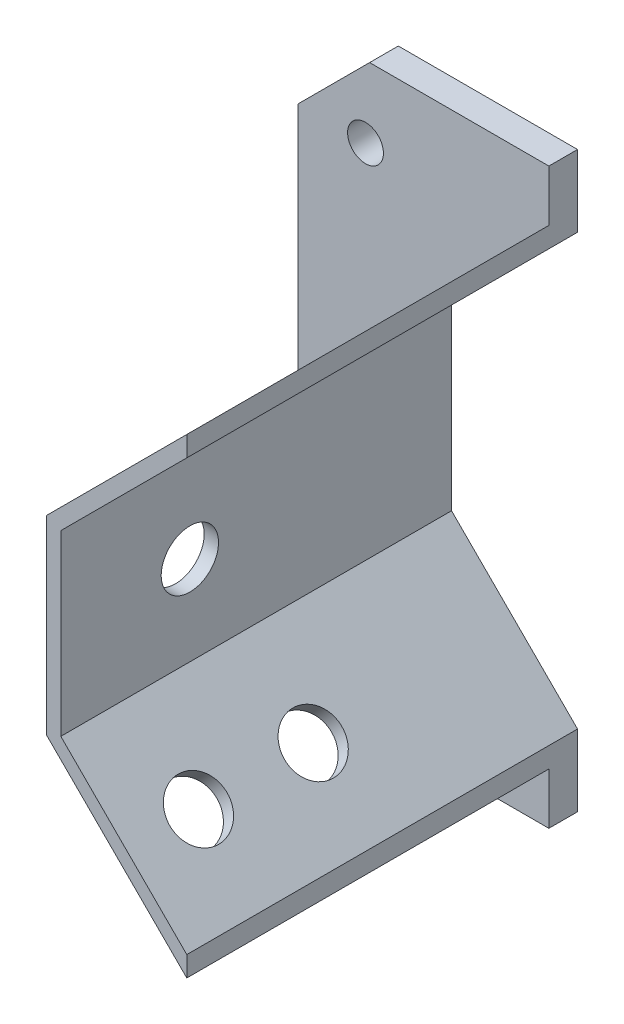
ISO-10303-21;
HEADER;
FILE_DESCRIPTION(('STEP AP214'),'2;1');
FILE_NAME('part.step','',(''),(''),'','','');
FILE_SCHEMA(('AUTOMOTIVE_DESIGN { 1 0 10303 214 1 1 1 1 }'));
ENDSEC;
DATA;
#1=APPLICATION_CONTEXT('core data for automotive mechanical design processes');
#2=APPLICATION_PROTOCOL_DEFINITION('international standard','automotive_design',2000,#1);
#3=PRODUCT_CONTEXT('',#1,'mechanical');
#4=PRODUCT('Part','Part','',(#3));
#5=PRODUCT_RELATED_PRODUCT_CATEGORY('part','',(#4));
#6=PRODUCT_DEFINITION_FORMATION('','',#4);
#7=PRODUCT_DEFINITION_CONTEXT('part definition',#1,'design');
#8=PRODUCT_DEFINITION('design','',#6,#7);
#9=PRODUCT_DEFINITION_SHAPE('','',#8);
#10=(LENGTH_UNIT() NAMED_UNIT(*) SI_UNIT(.MILLI.,.METRE.));
#11=(NAMED_UNIT(*) PLANE_ANGLE_UNIT() SI_UNIT($,.RADIAN.));
#12=(NAMED_UNIT(*) SI_UNIT($,.STERADIAN.) SOLID_ANGLE_UNIT());
#13=UNCERTAINTY_MEASURE_WITH_UNIT(LENGTH_MEASURE(1.E-05),#10,'distance_accuracy_value','');
#14=(GEOMETRIC_REPRESENTATION_CONTEXT(3) GLOBAL_UNCERTAINTY_ASSIGNED_CONTEXT((#13)) GLOBAL_UNIT_ASSIGNED_CONTEXT((#10,
#11,#12)) REPRESENTATION_CONTEXT('',''));
#15=CARTESIAN_POINT('',(0.,0.,0.));
#16=DIRECTION('',(0.,0.,1.));
#17=DIRECTION('',(1.,0.,0.));
#18=AXIS2_PLACEMENT_3D('',#15,#16,#17);
#19=CARTESIAN_POINT('',(-12.4264068711931,-32.8284271247461,50.5));
#20=DIRECTION('',(0.707106781186551,0.707106781186544,0.));
#21=DIRECTION('',(-0.707106781186544,0.707106781186551,0.));
#22=AXIS2_PLACEMENT_3D('',#19,#20,#21);
#23=PLANE('',#22);
#24=CARTESIAN_POINT('',(-22.2132034355965,-23.0416305603425,40.5));
#25=DIRECTION('',(0.707106781186551,0.707106781186544,0.));
#26=DIRECTION('',(-0.707106781186544,0.707106781186551,0.));
#27=AXIS2_PLACEMENT_3D('',#24,#25,#26);
#28=CIRCLE('',#27,4.);
#29=CARTESIAN_POINT('',(-25.0416305603427,-20.2132034355963,40.5));
#30=VERTEX_POINT('',#29);
#31=EDGE_CURVE('E244',#30,#30,#28,.T.);
#32=ORIENTED_EDGE('',*,*,#31,.T.);
#33=EDGE_LOOP('',(#32));
#34=FACE_BOUND('',#33,.T.);
#35=DIRECTION('',(0.707106781186544,-0.707106781186551,0.));
#36=VECTOR('',#35,1.);
#37=CARTESIAN_POINT('',(-12.4264068711931,-32.8284271247461,0.));
#38=LINE('',#37,#36);
#39=CARTESIAN_POINT('',(-32.,-13.2548339959389,0.));
#40=VERTEX_POINT('',#39);
#41=CARTESIAN_POINT('',(-12.4264068711931,-32.8284271247461,0.));
#42=VERTEX_POINT('',#41);
#43=EDGE_CURVE('E195',#40,#42,#38,.T.);
#44=ORIENTED_EDGE('',*,*,#43,.T.);
#45=DIRECTION('',(0.,0.,-1.));
#46=VECTOR('',#45,1.);
#47=CARTESIAN_POINT('',(-12.4264068711931,-32.8284271247461,50.5));
#48=LINE('',#47,#46);
#49=CARTESIAN_POINT('',(-12.4264068711931,-32.8284271247461,50.5));
#50=VERTEX_POINT('',#49);
#51=EDGE_CURVE('E222',#50,#42,#48,.T.);
#52=ORIENTED_EDGE('',*,*,#51,.F.);
#53=DIRECTION('',(0.707106781186544,-0.707106781186551,0.));
#54=VECTOR('',#53,1.);
#55=CARTESIAN_POINT('',(-12.4264068711931,-32.8284271247461,50.5));
#56=LINE('',#55,#54);
#57=CARTESIAN_POINT('',(-32.,-13.2548339959389,50.5));
#58=VERTEX_POINT('',#57);
#59=EDGE_CURVE('E203',#58,#50,#56,.T.);
#60=ORIENTED_EDGE('',*,*,#59,.F.);
#61=DIRECTION('',(0.,0.,-1.));
#62=VECTOR('',#61,1.);
#63=CARTESIAN_POINT('',(-32.,-13.2548339959389,50.5));
#64=LINE('',#63,#62);
#65=EDGE_CURVE('E225',#58,#40,#64,.T.);
#66=ORIENTED_EDGE('',*,*,#65,.T.);
#67=EDGE_LOOP('',(#44,#52,#60,#66));
#68=FACE_BOUND('',#67,.T.);
#69=CARTESIAN_POINT('',(-22.2132034355965,-23.0416305603425,24.5));
#70=DIRECTION('',(0.707106781186551,0.707106781186544,0.));
#71=DIRECTION('',(-0.707106781186544,0.707106781186551,0.));
#72=AXIS2_PLACEMENT_3D('',#69,#70,#71);
#73=CIRCLE('',#72,4.);
#74=CARTESIAN_POINT('',(-25.0416305603427,-20.2132034355963,24.5));
#75=VERTEX_POINT('',#74);
#76=EDGE_CURVE('E247',#75,#75,#73,.T.);
#77=ORIENTED_EDGE('',*,*,#76,.T.);
#78=EDGE_LOOP('',(#77));
#79=FACE_BOUND('',#78,.T.);
#80=ADVANCED_FACE('F32',(#34,#68,#79),#23,.F.);
#81=CARTESIAN_POINT('',(-12.4264068711931,-29.9999999999999,50.5));
#82=DIRECTION('',(-0.707106781186551,-0.707106781186544,0.));
#83=DIRECTION('',(0.707106781186544,-0.707106781186551,0.));
#84=AXIS2_PLACEMENT_3D('',#81,#82,#83);
#85=PLANE('',#84);
#86=CARTESIAN_POINT('',(-20.7989898732234,-21.6274169979694,40.5));
#87=DIRECTION('',(-0.707106781186551,-0.707106781186544,0.));
#88=DIRECTION('',(0.707106781186544,-0.707106781186551,0.));
#89=AXIS2_PLACEMENT_3D('',#86,#87,#88);
#90=CIRCLE('',#89,4.);
#91=CARTESIAN_POINT('',(-17.9705627484773,-24.4558441227156,40.5));
#92=VERTEX_POINT('',#91);
#93=EDGE_CURVE('E240',#92,#92,#90,.F.);
#94=ORIENTED_EDGE('',*,*,#93,.F.);
#95=EDGE_LOOP('',(#94));
#96=FACE_BOUND('',#95,.T.);
#97=DIRECTION('',(0.,0.,-1.));
#98=VECTOR('',#97,1.);
#99=CARTESIAN_POINT('',(-12.4264068711931,-29.9999999999999,50.5));
#100=LINE('',#99,#98);
#101=CARTESIAN_POINT('',(-12.4264068711931,-29.9999999999999,50.5));
#102=VERTEX_POINT('',#101);
#103=CARTESIAN_POINT('',(-12.4264068711931,-29.9999999999999,-4.));
#104=VERTEX_POINT('',#103);
#105=EDGE_CURVE('E226',#102,#104,#100,.T.);
#106=ORIENTED_EDGE('',*,*,#105,.T.);
#107=DIRECTION('',(0.707106781186544,-0.707106781186551,0.));
#108=VECTOR('',#107,1.);
#109=CARTESIAN_POINT('',(-12.4264068711931,-29.9999999999999,-4.));
#110=LINE('',#109,#108);
#111=CARTESIAN_POINT('',(-30.,-12.4264068711928,-4.));
#112=VERTEX_POINT('',#111);
#113=EDGE_CURVE('E158',#112,#104,#110,.T.);
#114=ORIENTED_EDGE('',*,*,#113,.F.);
#115=DIRECTION('',(0.,0.,-1.));
#116=VECTOR('',#115,1.);
#117=CARTESIAN_POINT('',(-30.,-12.4264068711928,50.5));
#118=LINE('',#117,#116);
#119=CARTESIAN_POINT('',(-30.,-12.4264068711928,50.5));
#120=VERTEX_POINT('',#119);
#121=EDGE_CURVE('E155',#120,#112,#118,.T.);
#122=ORIENTED_EDGE('',*,*,#121,.F.);
#123=DIRECTION('',(-0.707106781186544,0.707106781186551,0.));
#124=VECTOR('',#123,1.);
#125=CARTESIAN_POINT('',(-12.4264068711931,-29.9999999999999,50.5));
#126=LINE('',#125,#124);
#127=EDGE_CURVE('E207',#102,#120,#126,.T.);
#128=ORIENTED_EDGE('',*,*,#127,.F.);
#129=EDGE_LOOP('',(#106,#114,#122,#128));
#130=FACE_BOUND('',#129,.T.);
#131=CARTESIAN_POINT('',(-20.7989898732234,-21.6274169979694,24.5));
#132=DIRECTION('',(-0.707106781186551,-0.707106781186544,0.));
#133=DIRECTION('',(0.707106781186544,-0.707106781186551,0.));
#134=AXIS2_PLACEMENT_3D('',#131,#132,#133);
#135=CIRCLE('',#134,4.);
#136=CARTESIAN_POINT('',(-17.9705627484773,-24.4558441227156,24.5));
#137=VERTEX_POINT('',#136);
#138=EDGE_CURVE('E245',#137,#137,#135,.F.);
#139=ORIENTED_EDGE('',*,*,#138,.F.);
#140=EDGE_LOOP('',(#139));
#141=FACE_BOUND('',#140,.T.);
#142=ADVANCED_FACE('F298',(#96,#130,#141),#85,.F.);
#143=CARTESIAN_POINT('',(-30.,12.4264068711928,50.5));
#144=DIRECTION('',(-1.,0.,0.));
#145=DIRECTION('',(0.,0.,1.));
#146=AXIS2_PLACEMENT_3D('',#143,#144,#145);
#147=PLANE('',#146);
#148=CARTESIAN_POINT('',(-30.,0.,32.5));
#149=DIRECTION('',(-1.,0.,0.));
#150=DIRECTION('',(0.,0.,1.));
#151=AXIS2_PLACEMENT_3D('',#148,#149,#150);
#152=CIRCLE('',#151,4.);
#153=CARTESIAN_POINT('',(-30.,0.,36.5));
#154=VERTEX_POINT('',#153);
#155=EDGE_CURVE('E267',#154,#154,#152,.T.);
#156=ORIENTED_EDGE('',*,*,#155,.T.);
#157=EDGE_LOOP('',(#156));
#158=FACE_BOUND('',#157,.T.);
#159=ORIENTED_EDGE('',*,*,#121,.T.);
#160=DIRECTION('',(0.,-1.,0.));
#161=VECTOR('',#160,1.);
#162=CARTESIAN_POINT('',(-30.,-12.4264068711928,-4.));
#163=LINE('',#162,#161);
#164=CARTESIAN_POINT('',(-30.,12.4264068711928,-4.));
#165=VERTEX_POINT('',#164);
#166=EDGE_CURVE('E152',#165,#112,#163,.T.);
#167=ORIENTED_EDGE('',*,*,#166,.F.);
#168=DIRECTION('',(0.,0.,-1.));
#169=VECTOR('',#168,1.);
#170=CARTESIAN_POINT('',(-30.,12.4264068711928,50.5));
#171=LINE('',#170,#169);
#172=CARTESIAN_POINT('',(-30.,12.4264068711928,50.5));
#173=VERTEX_POINT('',#172);
#174=EDGE_CURVE('E138',#173,#165,#171,.T.);
#175=ORIENTED_EDGE('',*,*,#174,.F.);
#176=DIRECTION('',(0.,1.,0.));
#177=VECTOR('',#176,1.);
#178=CARTESIAN_POINT('',(-30.,12.4264068711928,50.5));
#179=LINE('',#178,#177);
#180=EDGE_CURVE('E193',#120,#173,#179,.T.);
#181=ORIENTED_EDGE('',*,*,#180,.F.);
#182=EDGE_LOOP('',(#159,#167,#175,#181));
#183=FACE_BOUND('',#182,.T.);
#184=ADVANCED_FACE('F153',(#158,#183),#147,.F.);
#185=CARTESIAN_POINT('',(-12.4264068711931,29.9999999999999,50.5));
#186=DIRECTION('',(-0.707106781186551,0.707106781186544,0.));
#187=DIRECTION('',(-0.707106781186544,-0.707106781186551,0.));
#188=AXIS2_PLACEMENT_3D('',#185,#186,#187);
#189=PLANE('',#188);
#190=CARTESIAN_POINT('',(-20.7989898732234,21.6274169979694,24.5));
#191=DIRECTION('',(-0.707106781186551,0.707106781186544,0.));
#192=DIRECTION('',(-0.707106781186544,-0.707106781186551,0.));
#193=AXIS2_PLACEMENT_3D('',#190,#191,#192);
#194=CIRCLE('',#193,4.);
#195=CARTESIAN_POINT('',(-23.6274169979696,18.7989898732232,24.5));
#196=VERTEX_POINT('',#195);
#197=EDGE_CURVE('E273',#196,#196,#194,.T.);
#198=ORIENTED_EDGE('',*,*,#197,.T.);
#199=EDGE_LOOP('',(#198));
#200=FACE_BOUND('',#199,.T.);
#201=CARTESIAN_POINT('',(-20.7989898732234,21.6274169979694,40.5));
#202=DIRECTION('',(-0.707106781186551,0.707106781186544,0.));
#203=DIRECTION('',(-0.707106781186544,-0.707106781186551,0.));
#204=AXIS2_PLACEMENT_3D('',#201,#202,#203);
#205=CIRCLE('',#204,4.);
#206=CARTESIAN_POINT('',(-23.6274169979696,18.7989898732232,40.5));
#207=VERTEX_POINT('',#206);
#208=EDGE_CURVE('E170',#207,#207,#205,.T.);
#209=ORIENTED_EDGE('',*,*,#208,.T.);
#210=EDGE_LOOP('',(#209));
#211=FACE_BOUND('',#210,.T.);
#212=ORIENTED_EDGE('',*,*,#174,.T.);
#213=DIRECTION('',(-0.707106781186544,-0.707106781186551,0.));
#214=VECTOR('',#213,1.);
#215=CARTESIAN_POINT('',(-30.,12.4264068711928,-4.));
#216=LINE('',#215,#214);
#217=CARTESIAN_POINT('',(-12.4264068711931,29.9999999999999,-4.));
#218=VERTEX_POINT('',#217);
#219=EDGE_CURVE('E143',#218,#165,#216,.T.);
#220=ORIENTED_EDGE('',*,*,#219,.F.);
#221=DIRECTION('',(0.,0.,-1.));
#222=VECTOR('',#221,1.);
#223=CARTESIAN_POINT('',(-12.4264068711931,29.9999999999999,50.5));
#224=LINE('',#223,#222);
#225=CARTESIAN_POINT('',(-12.4264068711931,29.9999999999999,50.5));
#226=VERTEX_POINT('',#225);
#227=EDGE_CURVE('E149',#226,#218,#224,.T.);
#228=ORIENTED_EDGE('',*,*,#227,.F.);
#229=DIRECTION('',(0.707106781186544,0.707106781186551,0.));
#230=VECTOR('',#229,1.);
#231=CARTESIAN_POINT('',(-12.4264068711931,29.9999999999999,50.5));
#232=LINE('',#231,#230);
#233=EDGE_CURVE('E144',#173,#226,#232,.T.);
#234=ORIENTED_EDGE('',*,*,#233,.F.);
#235=EDGE_LOOP('',(#212,#220,#228,#234));
#236=FACE_BOUND('',#235,.T.);
#237=ADVANCED_FACE('F140',(#200,#211,#236),#189,.F.);
#238=CARTESIAN_POINT('',(-12.4264068711931,29.9999999999999,50.5));
#239=DIRECTION('',(-1.,0.,0.));
#240=DIRECTION('',(0.,0.,1.));
#241=AXIS2_PLACEMENT_3D('',#238,#239,#240);
#242=PLANE('',#241);
#243=ORIENTED_EDGE('',*,*,#227,.T.);
#244=DIRECTION('',(0.,-1.,0.));
#245=VECTOR('',#244,1.);
#246=CARTESIAN_POINT('',(-12.4264068711931,29.9999999999999,-4.));
#247=LINE('',#246,#245);
#248=CARTESIAN_POINT('',(-12.4264068711931,39.9999999999999,-4.));
#249=VERTEX_POINT('',#248);
#250=EDGE_CURVE('E163',#249,#218,#247,.T.);
#251=ORIENTED_EDGE('',*,*,#250,.F.);
#252=DIRECTION('',(0.,0.,1.));
#253=VECTOR('',#252,1.);
#254=CARTESIAN_POINT('',(-12.4264068711931,39.9999999999999,-4.));
#255=LINE('',#254,#253);
#256=CARTESIAN_POINT('',(-12.4264068711931,39.9999999999999,0.));
#257=VERTEX_POINT('',#256);
#258=EDGE_CURVE('E183',#249,#257,#255,.T.);
#259=ORIENTED_EDGE('',*,*,#258,.T.);
#260=DIRECTION('',(0.,-1.,0.));
#261=VECTOR('',#260,1.);
#262=CARTESIAN_POINT('',(-12.4264068711931,29.9999999999999,0.));
#263=LINE('',#262,#261);
#264=CARTESIAN_POINT('',(-12.4264068711931,32.8284271247461,0.));
#265=VERTEX_POINT('',#264);
#266=EDGE_CURVE('E164',#257,#265,#263,.T.);
#267=ORIENTED_EDGE('',*,*,#266,.T.);
#268=DIRECTION('',(0.,0.,-1.));
#269=VECTOR('',#268,1.);
#270=CARTESIAN_POINT('',(-12.4264068711931,32.8284271247461,50.5));
#271=LINE('',#270,#269);
#272=CARTESIAN_POINT('',(-12.4264068711931,32.8284271247461,50.5));
#273=VERTEX_POINT('',#272);
#274=EDGE_CURVE('E367',#273,#265,#271,.T.);
#275=ORIENTED_EDGE('',*,*,#274,.F.);
#276=DIRECTION('',(0.,1.,0.));
#277=VECTOR('',#276,1.);
#278=CARTESIAN_POINT('',(-12.4264068711931,29.9999999999999,50.5));
#279=LINE('',#278,#277);
#280=EDGE_CURVE('E197',#226,#273,#279,.T.);
#281=ORIENTED_EDGE('',*,*,#280,.F.);
#282=EDGE_LOOP('',(#243,#251,#259,#267,#275,#281));
#283=FACE_BOUND('',#282,.T.);
#284=ADVANCED_FACE('F317',(#283),#242,.F.);
#285=CARTESIAN_POINT('',(-12.4264068711931,32.8284271247461,50.5));
#286=DIRECTION('',(0.707106781186551,-0.707106781186544,0.));
#287=DIRECTION('',(0.707106781186544,0.707106781186551,0.));
#288=AXIS2_PLACEMENT_3D('',#285,#286,#287);
#289=PLANE('',#288);
#290=CARTESIAN_POINT('',(-22.2132034355965,23.0416305603425,24.5));
#291=DIRECTION('',(-0.707106781186551,0.707106781186544,0.));
#292=DIRECTION('',(-0.707106781186544,-0.707106781186551,0.));
#293=AXIS2_PLACEMENT_3D('',#290,#291,#292);
#294=CIRCLE('',#293,4.);
#295=CARTESIAN_POINT('',(-25.0416305603427,20.2132034355963,24.5));
#296=VERTEX_POINT('',#295);
#297=EDGE_CURVE('E270',#296,#296,#294,.T.);
#298=ORIENTED_EDGE('',*,*,#297,.F.);
#299=EDGE_LOOP('',(#298));
#300=FACE_BOUND('',#299,.T.);
#301=CARTESIAN_POINT('',(-22.2132034355965,23.0416305603425,40.5));
#302=DIRECTION('',(-0.707106781186551,0.707106781186544,0.));
#303=DIRECTION('',(-0.707106781186544,-0.707106781186551,0.));
#304=AXIS2_PLACEMENT_3D('',#301,#302,#303);
#305=CIRCLE('',#304,4.);
#306=CARTESIAN_POINT('',(-25.0416305603427,20.2132034355963,40.5));
#307=VERTEX_POINT('',#306);
#308=EDGE_CURVE('E275',#307,#307,#305,.T.);
#309=ORIENTED_EDGE('',*,*,#308,.F.);
#310=EDGE_LOOP('',(#309));
#311=FACE_BOUND('',#310,.T.);
#312=DIRECTION('',(-0.707106781186543,-0.707106781186551,0.));
#313=VECTOR('',#312,1.);
#314=CARTESIAN_POINT('',(-12.4264068711931,32.8284271247461,0.));
#315=LINE('',#314,#313);
#316=CARTESIAN_POINT('',(-32.,13.2548339959389,0.));
#317=VERTEX_POINT('',#316);
#318=EDGE_CURVE('E212',#265,#317,#315,.T.);
#319=ORIENTED_EDGE('',*,*,#318,.T.);
#320=DIRECTION('',(0.,0.,-1.));
#321=VECTOR('',#320,1.);
#322=CARTESIAN_POINT('',(-32.,13.2548339959389,50.5));
#323=LINE('',#322,#321);
#324=CARTESIAN_POINT('',(-32.,13.2548339959389,50.5));
#325=VERTEX_POINT('',#324);
#326=EDGE_CURVE('E368',#325,#317,#323,.T.);
#327=ORIENTED_EDGE('',*,*,#326,.F.);
#328=DIRECTION('',(-0.707106781186543,-0.707106781186551,0.));
#329=VECTOR('',#328,1.);
#330=CARTESIAN_POINT('',(-12.4264068711931,32.8284271247461,50.5));
#331=LINE('',#330,#329);
#332=EDGE_CURVE('E199',#273,#325,#331,.T.);
#333=ORIENTED_EDGE('',*,*,#332,.F.);
#334=ORIENTED_EDGE('',*,*,#274,.T.);
#335=EDGE_LOOP('',(#319,#327,#333,#334));
#336=FACE_BOUND('',#335,.T.);
#337=ADVANCED_FACE('F313',(#300,#311,#336),#289,.F.);
#338=CARTESIAN_POINT('',(-32.,13.2548339959389,50.5));
#339=DIRECTION('',(1.,0.,0.));
#340=DIRECTION('',(0.,0.,-1.));
#341=AXIS2_PLACEMENT_3D('',#338,#339,#340);
#342=PLANE('',#341);
#343=CARTESIAN_POINT('',(-32.,0.,32.5));
#344=DIRECTION('',(-1.,0.,0.));
#345=DIRECTION('',(0.,0.,1.));
#346=AXIS2_PLACEMENT_3D('',#343,#344,#345);
#347=CIRCLE('',#346,4.);
#348=CARTESIAN_POINT('',(-32.,0.,36.5));
#349=VERTEX_POINT('',#348);
#350=EDGE_CURVE('E243',#349,#349,#347,.T.);
#351=ORIENTED_EDGE('',*,*,#350,.F.);
#352=EDGE_LOOP('',(#351));
#353=FACE_BOUND('',#352,.T.);
#354=DIRECTION('',(0.,-1.,0.));
#355=VECTOR('',#354,1.);
#356=CARTESIAN_POINT('',(-32.,13.2548339959389,0.));
#357=LINE('',#356,#355);
#358=EDGE_CURVE('E209',#317,#40,#357,.T.);
#359=ORIENTED_EDGE('',*,*,#358,.T.);
#360=ORIENTED_EDGE('',*,*,#65,.F.);
#361=DIRECTION('',(0.,-1.,0.));
#362=VECTOR('',#361,1.);
#363=CARTESIAN_POINT('',(-32.,13.2548339959389,50.5));
#364=LINE('',#363,#362);
#365=EDGE_CURVE('E201',#325,#58,#364,.T.);
#366=ORIENTED_EDGE('',*,*,#365,.F.);
#367=ORIENTED_EDGE('',*,*,#326,.T.);
#368=EDGE_LOOP('',(#359,#360,#366,#367));
#369=FACE_BOUND('',#368,.T.);
#370=ADVANCED_FACE('F310',(#353,#369),#342,.F.);
#371=CARTESIAN_POINT('',(-12.4264068711931,-29.9999999999999,50.5));
#372=DIRECTION('',(-1.,0.,0.));
#373=DIRECTION('',(0.,0.,1.));
#374=AXIS2_PLACEMENT_3D('',#371,#372,#373);
#375=PLANE('',#374);
#376=ORIENTED_EDGE('',*,*,#51,.T.);
#377=DIRECTION('',(0.,-1.,0.));
#378=VECTOR('',#377,1.);
#379=CARTESIAN_POINT('',(-12.4264068711931,-39.9999999999999,0.));
#380=LINE('',#379,#378);
#381=CARTESIAN_POINT('',(-12.4264068711931,-39.9999999999999,0.));
#382=VERTEX_POINT('',#381);
#383=EDGE_CURVE('E189',#42,#382,#380,.T.);
#384=ORIENTED_EDGE('',*,*,#383,.T.);
#385=DIRECTION('',(0.,0.,1.));
#386=VECTOR('',#385,1.);
#387=CARTESIAN_POINT('',(-12.4264068711931,-39.9999999999999,-4.));
#388=LINE('',#387,#386);
#389=CARTESIAN_POINT('',(-12.4264068711931,-39.9999999999999,-4.));
#390=VERTEX_POINT('',#389);
#391=EDGE_CURVE('E354',#390,#382,#388,.T.);
#392=ORIENTED_EDGE('',*,*,#391,.F.);
#393=DIRECTION('',(0.,-1.,0.));
#394=VECTOR('',#393,1.);
#395=CARTESIAN_POINT('',(-12.4264068711931,-39.9999999999999,-4.));
#396=LINE('',#395,#394);
#397=EDGE_CURVE('E174',#104,#390,#396,.T.);
#398=ORIENTED_EDGE('',*,*,#397,.F.);
#399=ORIENTED_EDGE('',*,*,#105,.F.);
#400=DIRECTION('',(0.,1.,0.));
#401=VECTOR('',#400,1.);
#402=CARTESIAN_POINT('',(-12.4264068711931,-29.9999999999999,50.5));
#403=LINE('',#402,#401);
#404=EDGE_CURVE('E205',#50,#102,#403,.T.);
#405=ORIENTED_EDGE('',*,*,#404,.F.);
#406=EDGE_LOOP('',(#376,#384,#392,#398,#399,#405));
#407=FACE_BOUND('',#406,.T.);
#408=ADVANCED_FACE('F309',(#407),#375,.F.);
#409=CARTESIAN_POINT('',(-30.,-12.4264068711928,50.5));
#410=DIRECTION('',(0.,0.,-1.));
#411=DIRECTION('',(-1.,0.,0.));
#412=AXIS2_PLACEMENT_3D('',#409,#410,#411);
#413=PLANE('',#412);
#414=ORIENTED_EDGE('',*,*,#180,.T.);
#415=ORIENTED_EDGE('',*,*,#233,.T.);
#416=ORIENTED_EDGE('',*,*,#280,.T.);
#417=ORIENTED_EDGE('',*,*,#332,.T.);
#418=ORIENTED_EDGE('',*,*,#365,.T.);
#419=ORIENTED_EDGE('',*,*,#59,.T.);
#420=ORIENTED_EDGE('',*,*,#404,.T.);
#421=ORIENTED_EDGE('',*,*,#127,.T.);
#422=EDGE_LOOP('',(#414,#415,#416,#417,#418,#419,#420,#421));
#423=FACE_BOUND('',#422,.T.);
#424=ADVANCED_FACE('F391',(#423),#413,.F.);
#425=CARTESIAN_POINT('',(-42.4264068711926,0.,0.));
#426=DIRECTION('',(0.,0.,1.));
#427=DIRECTION('',(1.,0.,0.));
#428=AXIS2_PLACEMENT_3D('',#425,#426,#427);
#429=PLANE('',#428);
#430=CARTESIAN_POINT('',(-38.,-30.,0.));
#431=DIRECTION('',(0.,0.,1.));
#432=DIRECTION('',(-1.,0.,0.));
#433=AXIS2_PLACEMENT_3D('',#430,#431,#432);
#434=CIRCLE('',#433,2.5);
#435=CARTESIAN_POINT('',(-40.5,-30.,0.));
#436=VERTEX_POINT('',#435);
#437=EDGE_CURVE('E260',#436,#436,#434,.T.);
#438=ORIENTED_EDGE('',*,*,#437,.F.);
#439=EDGE_LOOP('',(#438));
#440=FACE_BOUND('',#439,.T.);
#441=CARTESIAN_POINT('',(-38.,30.,0.));
#442=DIRECTION('',(0.,0.,1.));
#443=DIRECTION('',(1.,0.,0.));
#444=AXIS2_PLACEMENT_3D('',#441,#442,#443);
#445=CIRCLE('',#444,2.5);
#446=CARTESIAN_POINT('',(-35.5,30.,0.));
#447=VERTEX_POINT('',#446);
#448=EDGE_CURVE('E250',#447,#447,#445,.T.);
#449=ORIENTED_EDGE('',*,*,#448,.F.);
#450=EDGE_LOOP('',(#449));
#451=FACE_BOUND('',#450,.T.);
#452=DIRECTION('',(0.,1.,0.));
#453=VECTOR('',#452,1.);
#454=CARTESIAN_POINT('',(-47.4264068711931,39.9999999999999,0.));
#455=LINE('',#454,#453);
#456=CARTESIAN_POINT('',(-47.4264068711931,-29.9999999999999,0.));
#457=VERTEX_POINT('',#456);
#458=CARTESIAN_POINT('',(-47.4264068711931,29.9999999999998,0.));
#459=VERTEX_POINT('',#458);
#460=EDGE_CURVE('E342',#457,#459,#455,.T.);
#461=ORIENTED_EDGE('',*,*,#460,.F.);
#462=DIRECTION('',(-0.707106781186549,0.707106781186546,0.));
#463=VECTOR('',#462,1.);
#464=CARTESIAN_POINT('',(-59.9264068711928,-17.5000000000002,0.));
#465=LINE('',#464,#463);
#466=CARTESIAN_POINT('',(-37.426406871193,-39.9999999999999,0.));
#467=VERTEX_POINT('',#466);
#468=EDGE_CURVE('E235',#457,#467,#465,.F.);
#469=ORIENTED_EDGE('',*,*,#468,.T.);
#470=DIRECTION('',(-1.,0.,0.));
#471=VECTOR('',#470,1.);
#472=CARTESIAN_POINT('',(-47.4264068711931,-39.9999999999999,0.));
#473=LINE('',#472,#471);
#474=EDGE_CURVE('E186',#382,#467,#473,.T.);
#475=ORIENTED_EDGE('',*,*,#474,.F.);
#476=ORIENTED_EDGE('',*,*,#383,.F.);
#477=ORIENTED_EDGE('',*,*,#43,.F.);
#478=ORIENTED_EDGE('',*,*,#358,.F.);
#479=ORIENTED_EDGE('',*,*,#318,.F.);
#480=ORIENTED_EDGE('',*,*,#266,.F.);
#481=DIRECTION('',(1.,0.,0.));
#482=VECTOR('',#481,1.);
#483=CARTESIAN_POINT('',(-12.4264068711931,39.9999999999999,0.));
#484=LINE('',#483,#482);
#485=CARTESIAN_POINT('',(-37.4264068711931,39.9999999999999,0.));
#486=VERTEX_POINT('',#485);
#487=EDGE_CURVE('E167',#486,#257,#484,.T.);
#488=ORIENTED_EDGE('',*,*,#487,.F.);
#489=DIRECTION('',(0.707106781186546,0.707106781186549,0.));
#490=VECTOR('',#489,1.);
#491=CARTESIAN_POINT('',(-59.9264068711928,17.5000000000001,0.));
#492=LINE('',#491,#490);
#493=EDGE_CURVE('E233',#486,#459,#492,.F.);
#494=ORIENTED_EDGE('',*,*,#493,.T.);
#495=EDGE_LOOP('',(#461,#469,#475,#476,#477,#478,#479,#480,#488,#494));
#496=FACE_BOUND('',#495,.T.);
#497=ADVANCED_FACE('F350',(#440,#451,#496),#429,.T.);
#498=CARTESIAN_POINT('',(-47.4264068711931,-39.9999999999999,-4.));
#499=DIRECTION('',(0.,1.,0.));
#500=DIRECTION('',(-1.,0.,0.));
#501=AXIS2_PLACEMENT_3D('',#498,#499,#500);
#502=PLANE('',#501);
#503=ORIENTED_EDGE('',*,*,#474,.T.);
#504=DIRECTION('',(0.,0.,-1.));
#505=VECTOR('',#504,1.);
#506=CARTESIAN_POINT('',(-37.426406871193,-39.9999999999999,-4.));
#507=LINE('',#506,#505);
#508=CARTESIAN_POINT('',(-37.426406871193,-39.9999999999999,-4.));
#509=VERTEX_POINT('',#508);
#510=EDGE_CURVE('E57',#467,#509,#507,.T.);
#511=ORIENTED_EDGE('',*,*,#510,.T.);
#512=DIRECTION('',(-1.,0.,0.));
#513=VECTOR('',#512,1.);
#514=CARTESIAN_POINT('',(-47.4264068711931,-39.9999999999999,-4.));
#515=LINE('',#514,#513);
#516=EDGE_CURVE('E176',#390,#509,#515,.T.);
#517=ORIENTED_EDGE('',*,*,#516,.F.);
#518=ORIENTED_EDGE('',*,*,#391,.T.);
#519=EDGE_LOOP('',(#503,#511,#517,#518));
#520=FACE_BOUND('',#519,.T.);
#521=ADVANCED_FACE('F383',(#520),#502,.F.);
#522=CARTESIAN_POINT('',(-47.4264068711931,39.9999999999999,-4.));
#523=DIRECTION('',(1.,0.,0.));
#524=DIRECTION('',(0.,1.,0.));
#525=AXIS2_PLACEMENT_3D('',#522,#523,#524);
#526=PLANE('',#525);
#527=DIRECTION('',(0.,1.,0.));
#528=VECTOR('',#527,1.);
#529=CARTESIAN_POINT('',(-47.4264068711931,39.9999999999999,-4.));
#530=LINE('',#529,#528);
#531=CARTESIAN_POINT('',(-47.4264068711931,-29.9999999999999,-4.));
#532=VERTEX_POINT('',#531);
#533=CARTESIAN_POINT('',(-47.4264068711931,29.9999999999998,-4.));
#534=VERTEX_POINT('',#533);
#535=EDGE_CURVE('E178',#532,#534,#530,.T.);
#536=ORIENTED_EDGE('',*,*,#535,.F.);
#537=DIRECTION('',(0.,0.,1.));
#538=VECTOR('',#537,1.);
#539=CARTESIAN_POINT('',(-47.4264068711931,-29.9999999999999,-4.));
#540=LINE('',#539,#538);
#541=EDGE_CURVE('E230',#532,#457,#540,.T.);
#542=ORIENTED_EDGE('',*,*,#541,.T.);
#543=ORIENTED_EDGE('',*,*,#460,.T.);
#544=DIRECTION('',(0.,0.,-1.));
#545=VECTOR('',#544,1.);
#546=CARTESIAN_POINT('',(-47.4264068711931,29.9999999999998,-4.));
#547=LINE('',#546,#545);
#548=EDGE_CURVE('E148',#459,#534,#547,.T.);
#549=ORIENTED_EDGE('',*,*,#548,.T.);
#550=EDGE_LOOP('',(#536,#542,#543,#549));
#551=FACE_BOUND('',#550,.T.);
#552=ADVANCED_FACE('F338',(#551),#526,.F.);
#553=CARTESIAN_POINT('',(-12.4264068711931,39.9999999999999,-4.));
#554=DIRECTION('',(0.,-1.,0.));
#555=DIRECTION('',(0.,0.,-1.));
#556=AXIS2_PLACEMENT_3D('',#553,#554,#555);
#557=PLANE('',#556);
#558=DIRECTION('',(1.,0.,0.));
#559=VECTOR('',#558,1.);
#560=CARTESIAN_POINT('',(-12.4264068711931,39.9999999999999,-4.));
#561=LINE('',#560,#559);
#562=CARTESIAN_POINT('',(-37.4264068711931,39.9999999999999,-4.));
#563=VERTEX_POINT('',#562);
#564=EDGE_CURVE('E180',#563,#249,#561,.T.);
#565=ORIENTED_EDGE('',*,*,#564,.F.);
#566=DIRECTION('',(0.,0.,1.));
#567=VECTOR('',#566,1.);
#568=CARTESIAN_POINT('',(-37.4264068711931,39.9999999999999,-4.));
#569=LINE('',#568,#567);
#570=EDGE_CURVE('E11',#563,#486,#569,.T.);
#571=ORIENTED_EDGE('',*,*,#570,.T.);
#572=ORIENTED_EDGE('',*,*,#487,.T.);
#573=ORIENTED_EDGE('',*,*,#258,.F.);
#574=EDGE_LOOP('',(#565,#571,#572,#573));
#575=FACE_BOUND('',#574,.T.);
#576=ADVANCED_FACE('F332',(#575),#557,.F.);
#577=CARTESIAN_POINT('',(-42.4264068711926,0.,-4.));
#578=DIRECTION('',(0.,0.,1.));
#579=DIRECTION('',(1.,0.,0.));
#580=AXIS2_PLACEMENT_3D('',#577,#578,#579);
#581=PLANE('',#580);
#582=CARTESIAN_POINT('',(-38.,-30.,-4.));
#583=DIRECTION('',(0.,0.,1.));
#584=DIRECTION('',(1.,0.,0.));
#585=AXIS2_PLACEMENT_3D('',#582,#583,#584);
#586=CIRCLE('',#585,2.5);
#587=CARTESIAN_POINT('',(-35.5,-30.,-4.));
#588=VERTEX_POINT('',#587);
#589=EDGE_CURVE('E36',#588,#588,#586,.T.);
#590=ORIENTED_EDGE('',*,*,#589,.T.);
#591=EDGE_LOOP('',(#590));
#592=FACE_BOUND('',#591,.T.);
#593=CARTESIAN_POINT('',(-38.,30.,-4.));
#594=DIRECTION('',(0.,0.,1.));
#595=DIRECTION('',(1.,0.,0.));
#596=AXIS2_PLACEMENT_3D('',#593,#594,#595);
#597=CIRCLE('',#596,2.5);
#598=CARTESIAN_POINT('',(-35.5,30.,-4.));
#599=VERTEX_POINT('',#598);
#600=EDGE_CURVE('E248',#599,#599,#597,.T.);
#601=ORIENTED_EDGE('',*,*,#600,.T.);
#602=EDGE_LOOP('',(#601));
#603=FACE_BOUND('',#602,.T.);
#604=ORIENTED_EDGE('',*,*,#516,.T.);
#605=DIRECTION('',(0.707106781186549,-0.707106781186546,0.));
#606=VECTOR('',#605,1.);
#607=CARTESIAN_POINT('',(-47.4264068711931,-29.9999999999999,-4.));
#608=LINE('',#607,#606);
#609=EDGE_CURVE('E41',#509,#532,#608,.F.);
#610=ORIENTED_EDGE('',*,*,#609,.T.);
#611=ORIENTED_EDGE('',*,*,#535,.T.);
#612=DIRECTION('',(-0.707106781186546,-0.707106781186549,0.));
#613=VECTOR('',#612,1.);
#614=CARTESIAN_POINT('',(-37.4264068711931,39.9999999999999,-4.));
#615=LINE('',#614,#613);
#616=EDGE_CURVE('E49',#534,#563,#615,.F.);
#617=ORIENTED_EDGE('',*,*,#616,.T.);
#618=ORIENTED_EDGE('',*,*,#564,.T.);
#619=ORIENTED_EDGE('',*,*,#250,.T.);
#620=ORIENTED_EDGE('',*,*,#219,.T.);
#621=ORIENTED_EDGE('',*,*,#166,.T.);
#622=ORIENTED_EDGE('',*,*,#113,.T.);
#623=ORIENTED_EDGE('',*,*,#397,.T.);
#624=EDGE_LOOP('',(#604,#610,#611,#617,#618,#619,#620,#621,#622,#623));
#625=FACE_BOUND('',#624,.T.);
#626=ADVANCED_FACE('F161',(#592,#603,#625),#581,.F.);
#627=CARTESIAN_POINT('',(-47.4264068711931,-29.9999999999999,-4.));
#628=DIRECTION('',(0.707106781186546,0.707106781186549,0.));
#629=DIRECTION('',(-0.707106781186549,0.707106781186546,0.));
#630=AXIS2_PLACEMENT_3D('',#627,#628,#629);
#631=PLANE('',#630);
#632=ORIENTED_EDGE('',*,*,#609,.F.);
#633=ORIENTED_EDGE('',*,*,#510,.F.);
#634=ORIENTED_EDGE('',*,*,#468,.F.);
#635=ORIENTED_EDGE('',*,*,#541,.F.);
#636=EDGE_LOOP('',(#632,#633,#634,#635));
#637=FACE_BOUND('',#636,.T.);
#638=ADVANCED_FACE('F294',(#637),#631,.F.);
#639=CARTESIAN_POINT('',(-37.4264068711931,39.9999999999999,-4.));
#640=DIRECTION('',(0.707106781186549,-0.707106781186546,0.));
#641=DIRECTION('',(0.707106781186546,0.707106781186549,0.));
#642=AXIS2_PLACEMENT_3D('',#639,#640,#641);
#643=PLANE('',#642);
#644=ORIENTED_EDGE('',*,*,#616,.F.);
#645=ORIENTED_EDGE('',*,*,#548,.F.);
#646=ORIENTED_EDGE('',*,*,#493,.F.);
#647=ORIENTED_EDGE('',*,*,#570,.F.);
#648=EDGE_LOOP('',(#644,#645,#646,#647));
#649=FACE_BOUND('',#648,.T.);
#650=ADVANCED_FACE('F34',(#649),#643,.F.);
#651=CARTESIAN_POINT('',(-15.142135623731,15.9705627484771,40.5));
#652=DIRECTION('',(-0.707106781186551,0.707106781186544,0.));
#653=DIRECTION('',(-0.707106781186544,-0.707106781186551,0.));
#654=AXIS2_PLACEMENT_3D('',#651,#652,#653);
#655=CYLINDRICAL_SURFACE('',#654,4.);
#656=ORIENTED_EDGE('',*,*,#308,.T.);
#657=EDGE_LOOP('',(#656));
#658=FACE_BOUND('',#657,.T.);
#659=ORIENTED_EDGE('',*,*,#208,.F.);
#660=EDGE_LOOP('',(#659));
#661=FACE_BOUND('',#660,.T.);
#662=ADVANCED_FACE('F283',(#658,#661),#655,.F.);
#663=CARTESIAN_POINT('',(-15.142135623731,15.9705627484771,24.5));
#664=DIRECTION('',(-0.707106781186551,0.707106781186544,0.));
#665=DIRECTION('',(-0.707106781186544,-0.707106781186551,0.));
#666=AXIS2_PLACEMENT_3D('',#663,#664,#665);
#667=CYLINDRICAL_SURFACE('',#666,4.);
#668=ORIENTED_EDGE('',*,*,#297,.T.);
#669=EDGE_LOOP('',(#668));
#670=FACE_BOUND('',#669,.T.);
#671=ORIENTED_EDGE('',*,*,#197,.F.);
#672=EDGE_LOOP('',(#671));
#673=FACE_BOUND('',#672,.T.);
#674=ADVANCED_FACE('F285',(#670,#673),#667,.F.);
#675=CARTESIAN_POINT('',(-22.,0.,32.5));
#676=DIRECTION('',(-1.,0.,0.));
#677=DIRECTION('',(0.,0.,1.));
#678=AXIS2_PLACEMENT_3D('',#675,#676,#677);
#679=CYLINDRICAL_SURFACE('',#678,4.);
#680=ORIENTED_EDGE('',*,*,#350,.T.);
#681=EDGE_LOOP('',(#680));
#682=FACE_BOUND('',#681,.T.);
#683=ORIENTED_EDGE('',*,*,#155,.F.);
#684=EDGE_LOOP('',(#683));
#685=FACE_BOUND('',#684,.T.);
#686=ADVANCED_FACE('F291',(#682,#685),#679,.F.);
#687=CARTESIAN_POINT('',(-15.142135623731,-15.9705627484771,40.5));
#688=DIRECTION('',(-0.707106781186551,-0.707106781186544,0.));
#689=DIRECTION('',(0.707106781186544,-0.707106781186551,0.));
#690=AXIS2_PLACEMENT_3D('',#687,#688,#689);
#691=CYLINDRICAL_SURFACE('',#690,4.);
#692=ORIENTED_EDGE('',*,*,#31,.F.);
#693=EDGE_LOOP('',(#692));
#694=FACE_BOUND('',#693,.T.);
#695=ORIENTED_EDGE('',*,*,#93,.T.);
#696=EDGE_LOOP('',(#695));
#697=FACE_BOUND('',#696,.T.);
#698=ADVANCED_FACE('F412',(#694,#697),#691,.F.);
#699=CARTESIAN_POINT('',(-15.142135623731,-15.9705627484771,24.5));
#700=DIRECTION('',(-0.707106781186551,-0.707106781186544,0.));
#701=DIRECTION('',(0.707106781186544,-0.707106781186551,0.));
#702=AXIS2_PLACEMENT_3D('',#699,#700,#701);
#703=CYLINDRICAL_SURFACE('',#702,4.);
#704=ORIENTED_EDGE('',*,*,#76,.F.);
#705=EDGE_LOOP('',(#704));
#706=FACE_BOUND('',#705,.T.);
#707=ORIENTED_EDGE('',*,*,#138,.T.);
#708=EDGE_LOOP('',(#707));
#709=FACE_BOUND('',#708,.T.);
#710=ADVANCED_FACE('F408',(#706,#709),#703,.F.);
#711=CARTESIAN_POINT('',(-38.,30.,-10.));
#712=DIRECTION('',(0.,0.,1.));
#713=DIRECTION('',(1.,0.,0.));
#714=AXIS2_PLACEMENT_3D('',#711,#712,#713);
#715=CYLINDRICAL_SURFACE('',#714,2.5);
#716=ORIENTED_EDGE('',*,*,#448,.T.);
#717=EDGE_LOOP('',(#716));
#718=FACE_BOUND('',#717,.T.);
#719=ORIENTED_EDGE('',*,*,#600,.F.);
#720=EDGE_LOOP('',(#719));
#721=FACE_BOUND('',#720,.T.);
#722=ADVANCED_FACE('F411',(#718,#721),#715,.F.);
#723=CARTESIAN_POINT('',(-38.,-30.,-10.));
#724=DIRECTION('',(0.,0.,1.));
#725=DIRECTION('',(1.,0.,0.));
#726=AXIS2_PLACEMENT_3D('',#723,#724,#725);
#727=CYLINDRICAL_SURFACE('',#726,2.5);
#728=ORIENTED_EDGE('',*,*,#437,.T.);
#729=EDGE_LOOP('',(#728));
#730=FACE_BOUND('',#729,.T.);
#731=ORIENTED_EDGE('',*,*,#589,.F.);
#732=EDGE_LOOP('',(#731));
#733=FACE_BOUND('',#732,.T.);
#734=ADVANCED_FACE('F419',(#730,#733),#727,.F.);
#735=CLOSED_SHELL('',(#80,#142,#184,#237,#284,#337,#370,#408,#424,#497,#521,#552,#576,#626,#638,
#650,#662,#674,#686,#698,#710,#722,#734));
#736=MANIFOLD_SOLID_BREP('B2',#735);
#737=ADVANCED_BREP_SHAPE_REPRESENTATION('',(#18,#736),#14);
#738=SHAPE_DEFINITION_REPRESENTATION(#9,#737);
ENDSEC;
END-ISO-10303-21;
